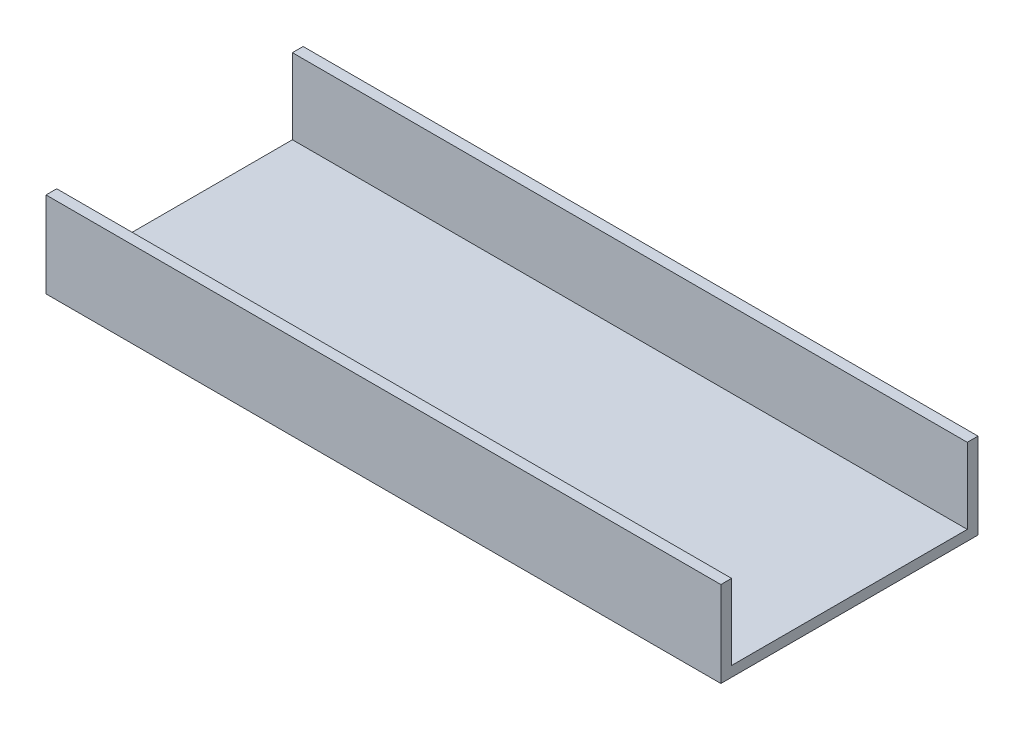
ISO-10303-21;
HEADER;
FILE_DESCRIPTION(('STEP AP214'),'2;1');
FILE_NAME('part.step','',(''),(''),'','','');
FILE_SCHEMA(('AUTOMOTIVE_DESIGN { 1 0 10303 214 1 1 1 1 }'));
ENDSEC;
DATA;
#1=APPLICATION_CONTEXT('core data for automotive mechanical design processes');
#2=APPLICATION_PROTOCOL_DEFINITION('international standard','automotive_design',2000,#1);
#3=PRODUCT_CONTEXT('',#1,'mechanical');
#4=PRODUCT('Part','Part','',(#3));
#5=PRODUCT_RELATED_PRODUCT_CATEGORY('part','',(#4));
#6=PRODUCT_DEFINITION_FORMATION('','',#4);
#7=PRODUCT_DEFINITION_CONTEXT('part definition',#1,'design');
#8=PRODUCT_DEFINITION('design','',#6,#7);
#9=PRODUCT_DEFINITION_SHAPE('','',#8);
#10=(LENGTH_UNIT() NAMED_UNIT(*) SI_UNIT(.MILLI.,.METRE.));
#11=(NAMED_UNIT(*) PLANE_ANGLE_UNIT() SI_UNIT($,.RADIAN.));
#12=(NAMED_UNIT(*) SI_UNIT($,.STERADIAN.) SOLID_ANGLE_UNIT());
#13=UNCERTAINTY_MEASURE_WITH_UNIT(LENGTH_MEASURE(1.E-05),#10,'distance_accuracy_value','');
#14=(GEOMETRIC_REPRESENTATION_CONTEXT(3) GLOBAL_UNCERTAINTY_ASSIGNED_CONTEXT((#13)) GLOBAL_UNIT_ASSIGNED_CONTEXT((#10,
#11,#12)) REPRESENTATION_CONTEXT('',''));
#15=CARTESIAN_POINT('',(0.,0.,0.));
#16=DIRECTION('',(0.,0.,1.));
#17=DIRECTION('',(1.,0.,0.));
#18=AXIS2_PLACEMENT_3D('',#15,#16,#17);
#19=CARTESIAN_POINT('',(200.,22.352,-48.7480799852219));
#20=DIRECTION('',(0.,-1.,0.));
#21=DIRECTION('',(0.,0.,-1.));
#22=AXIS2_PLACEMENT_3D('',#19,#20,#21);
#23=PLANE('',#22);
#24=DIRECTION('',(0.,0.,1.));
#25=VECTOR('',#24,1.);
#26=CARTESIAN_POINT('',(0.,22.352,-48.7480799852219));
#27=LINE('',#26,#25);
#28=CARTESIAN_POINT('',(0.,22.352,-51.9230799852219));
#29=VERTEX_POINT('',#28);
#30=CARTESIAN_POINT('',(0.,22.352,-48.7480799852219));
#31=VERTEX_POINT('',#30);
#32=EDGE_CURVE('E129',#29,#31,#27,.T.);
#33=ORIENTED_EDGE('',*,*,#32,.T.);
#34=DIRECTION('',(-1.,0.,0.));
#35=VECTOR('',#34,1.);
#36=CARTESIAN_POINT('',(200.,22.352,-48.7480799852219));
#37=LINE('',#36,#35);
#38=CARTESIAN_POINT('',(200.,22.352,-48.7480799852219));
#39=VERTEX_POINT('',#38);
#40=EDGE_CURVE('E11',#39,#31,#37,.T.);
#41=ORIENTED_EDGE('',*,*,#40,.F.);
#42=DIRECTION('',(0.,0.,1.));
#43=VECTOR('',#42,1.);
#44=CARTESIAN_POINT('',(200.,22.352,-48.7480799852219));
#45=LINE('',#44,#43);
#46=CARTESIAN_POINT('',(200.,22.352,-51.9230799852219));
#47=VERTEX_POINT('',#46);
#48=EDGE_CURVE('E143',#47,#39,#45,.T.);
#49=ORIENTED_EDGE('',*,*,#48,.F.);
#50=DIRECTION('',(-1.,0.,0.));
#51=VECTOR('',#50,1.);
#52=CARTESIAN_POINT('',(200.,22.352,-51.9230799852219));
#53=LINE('',#52,#51);
#54=EDGE_CURVE('E125',#47,#29,#53,.T.);
#55=ORIENTED_EDGE('',*,*,#54,.T.);
#56=EDGE_LOOP('',(#33,#41,#49,#55));
#57=FACE_BOUND('',#56,.T.);
#58=ADVANCED_FACE('F33',(#57),#23,.F.);
#59=CARTESIAN_POINT('',(200.,22.352,-48.7480799852219));
#60=DIRECTION('',(0.,0.,-1.));
#61=DIRECTION('',(-1.,0.,0.));
#62=AXIS2_PLACEMENT_3D('',#59,#60,#61);
#63=PLANE('',#62);
#64=DIRECTION('',(0.,-1.,0.));
#65=VECTOR('',#64,1.);
#66=CARTESIAN_POINT('',(0.,22.352,-48.7480799852219));
#67=LINE('',#66,#65);
#68=CARTESIAN_POINT('',(0.,0.,-48.7480799852219));
#69=VERTEX_POINT('',#68);
#70=EDGE_CURVE('E132',#31,#69,#67,.T.);
#71=ORIENTED_EDGE('',*,*,#70,.T.);
#72=DIRECTION('',(-1.,0.,0.));
#73=VECTOR('',#72,1.);
#74=CARTESIAN_POINT('',(200.,0.,-48.7480799852219));
#75=LINE('',#74,#73);
#76=CARTESIAN_POINT('',(200.,0.,-48.7480799852219));
#77=VERTEX_POINT('',#76);
#78=EDGE_CURVE('E41',#77,#69,#75,.T.);
#79=ORIENTED_EDGE('',*,*,#78,.F.);
#80=DIRECTION('',(0.,-1.,0.));
#81=VECTOR('',#80,1.);
#82=CARTESIAN_POINT('',(200.,22.352,-48.7480799852219));
#83=LINE('',#82,#81);
#84=EDGE_CURVE('E92',#39,#77,#83,.T.);
#85=ORIENTED_EDGE('',*,*,#84,.F.);
#86=ORIENTED_EDGE('',*,*,#40,.T.);
#87=EDGE_LOOP('',(#71,#79,#85,#86));
#88=FACE_BOUND('',#87,.T.);
#89=ADVANCED_FACE('F178',(#88),#63,.F.);
#90=CARTESIAN_POINT('',(200.,0.,-48.7480799852219));
#91=DIRECTION('',(0.,-1.,0.));
#92=DIRECTION('',(0.,0.,-1.));
#93=AXIS2_PLACEMENT_3D('',#90,#91,#92);
#94=PLANE('',#93);
#95=DIRECTION('',(0.,0.,1.));
#96=VECTOR('',#95,1.);
#97=CARTESIAN_POINT('',(0.,0.,-48.7480799852219));
#98=LINE('',#97,#96);
#99=CARTESIAN_POINT('',(0.,0.,21.1019200147781));
#100=VERTEX_POINT('',#99);
#101=EDGE_CURVE('E134',#69,#100,#98,.T.);
#102=ORIENTED_EDGE('',*,*,#101,.T.);
#103=DIRECTION('',(-1.,0.,0.));
#104=VECTOR('',#103,1.);
#105=CARTESIAN_POINT('',(200.,0.,21.1019200147781));
#106=LINE('',#105,#104);
#107=CARTESIAN_POINT('',(200.,0.,21.1019200147781));
#108=VERTEX_POINT('',#107);
#109=EDGE_CURVE('E150',#108,#100,#106,.T.);
#110=ORIENTED_EDGE('',*,*,#109,.F.);
#111=DIRECTION('',(0.,0.,1.));
#112=VECTOR('',#111,1.);
#113=CARTESIAN_POINT('',(200.,0.,-48.7480799852219));
#114=LINE('',#113,#112);
#115=EDGE_CURVE('E158',#77,#108,#114,.T.);
#116=ORIENTED_EDGE('',*,*,#115,.F.);
#117=ORIENTED_EDGE('',*,*,#78,.T.);
#118=EDGE_LOOP('',(#102,#110,#116,#117));
#119=FACE_BOUND('',#118,.T.);
#120=ADVANCED_FACE('F156',(#119),#94,.F.);
#121=CARTESIAN_POINT('',(200.,0.,21.1019200147781));
#122=DIRECTION('',(0.,0.,1.));
#123=DIRECTION('',(1.,0.,0.));
#124=AXIS2_PLACEMENT_3D('',#121,#122,#123);
#125=PLANE('',#124);
#126=DIRECTION('',(0.,1.,0.));
#127=VECTOR('',#126,1.);
#128=CARTESIAN_POINT('',(0.,0.,21.1019200147781));
#129=LINE('',#128,#127);
#130=CARTESIAN_POINT('',(0.,22.352,21.1019200147781));
#131=VERTEX_POINT('',#130);
#132=EDGE_CURVE('E136',#100,#131,#129,.T.);
#133=ORIENTED_EDGE('',*,*,#132,.T.);
#134=DIRECTION('',(-1.,0.,0.));
#135=VECTOR('',#134,1.);
#136=CARTESIAN_POINT('',(200.,22.352,21.1019200147781));
#137=LINE('',#136,#135);
#138=CARTESIAN_POINT('',(200.,22.352,21.1019200147781));
#139=VERTEX_POINT('',#138);
#140=EDGE_CURVE('E147',#139,#131,#137,.T.);
#141=ORIENTED_EDGE('',*,*,#140,.F.);
#142=DIRECTION('',(0.,1.,0.));
#143=VECTOR('',#142,1.);
#144=CARTESIAN_POINT('',(200.,0.,21.1019200147781));
#145=LINE('',#144,#143);
#146=EDGE_CURVE('E170',#108,#139,#145,.T.);
#147=ORIENTED_EDGE('',*,*,#146,.F.);
#148=ORIENTED_EDGE('',*,*,#109,.T.);
#149=EDGE_LOOP('',(#133,#141,#147,#148));
#150=FACE_BOUND('',#149,.T.);
#151=ADVANCED_FACE('F166',(#150),#125,.F.);
#152=CARTESIAN_POINT('',(200.,22.352,24.2769200147781));
#153=DIRECTION('',(0.,-1.,0.));
#154=DIRECTION('',(0.,0.,-1.));
#155=AXIS2_PLACEMENT_3D('',#152,#153,#154);
#156=PLANE('',#155);
#157=DIRECTION('',(0.,0.,1.));
#158=VECTOR('',#157,1.);
#159=CARTESIAN_POINT('',(0.,22.352,24.2769200147781));
#160=LINE('',#159,#158);
#161=CARTESIAN_POINT('',(0.,22.352,24.2769200147781));
#162=VERTEX_POINT('',#161);
#163=EDGE_CURVE('E138',#131,#162,#160,.T.);
#164=ORIENTED_EDGE('',*,*,#163,.T.);
#165=DIRECTION('',(-1.,0.,0.));
#166=VECTOR('',#165,1.);
#167=CARTESIAN_POINT('',(200.,22.352,24.2769200147781));
#168=LINE('',#167,#166);
#169=CARTESIAN_POINT('',(200.,22.352,24.2769200147781));
#170=VERTEX_POINT('',#169);
#171=EDGE_CURVE('E120',#170,#162,#168,.T.);
#172=ORIENTED_EDGE('',*,*,#171,.F.);
#173=DIRECTION('',(0.,0.,1.));
#174=VECTOR('',#173,1.);
#175=CARTESIAN_POINT('',(200.,22.352,24.2769200147781));
#176=LINE('',#175,#174);
#177=EDGE_CURVE('E111',#139,#170,#176,.T.);
#178=ORIENTED_EDGE('',*,*,#177,.F.);
#179=ORIENTED_EDGE('',*,*,#140,.T.);
#180=EDGE_LOOP('',(#164,#172,#178,#179));
#181=FACE_BOUND('',#180,.T.);
#182=ADVANCED_FACE('F169',(#181),#156,.F.);
#183=CARTESIAN_POINT('',(200.,-3.04800000000001,24.2769200147781));
#184=DIRECTION('',(0.,0.,-1.));
#185=DIRECTION('',(-1.,0.,0.));
#186=AXIS2_PLACEMENT_3D('',#183,#184,#185);
#187=PLANE('',#186);
#188=DIRECTION('',(0.,-1.,0.));
#189=VECTOR('',#188,1.);
#190=CARTESIAN_POINT('',(0.,-3.04800000000001,24.2769200147781));
#191=LINE('',#190,#189);
#192=CARTESIAN_POINT('',(0.,-3.04800000000001,24.2769200147781));
#193=VERTEX_POINT('',#192);
#194=EDGE_CURVE('E119',#162,#193,#191,.T.);
#195=ORIENTED_EDGE('',*,*,#194,.T.);
#196=DIRECTION('',(-1.,0.,0.));
#197=VECTOR('',#196,1.);
#198=CARTESIAN_POINT('',(200.,-3.04800000000001,24.2769200147781));
#199=LINE('',#198,#197);
#200=CARTESIAN_POINT('',(200.,-3.04800000000001,24.2769200147781));
#201=VERTEX_POINT('',#200);
#202=EDGE_CURVE('E116',#201,#193,#199,.T.);
#203=ORIENTED_EDGE('',*,*,#202,.F.);
#204=DIRECTION('',(0.,-1.,0.));
#205=VECTOR('',#204,1.);
#206=CARTESIAN_POINT('',(200.,-3.04800000000001,24.2769200147781));
#207=LINE('',#206,#205);
#208=EDGE_CURVE('E105',#170,#201,#207,.T.);
#209=ORIENTED_EDGE('',*,*,#208,.F.);
#210=ORIENTED_EDGE('',*,*,#171,.T.);
#211=EDGE_LOOP('',(#195,#203,#209,#210));
#212=FACE_BOUND('',#211,.T.);
#213=ADVANCED_FACE('F117',(#212),#187,.F.);
#214=CARTESIAN_POINT('',(200.,-3.048,-51.9230799852219));
#215=DIRECTION('',(0.,1.,0.));
#216=DIRECTION('',(0.,0.,1.));
#217=AXIS2_PLACEMENT_3D('',#214,#215,#216);
#218=PLANE('',#217);
#219=DIRECTION('',(0.,0.,-1.));
#220=VECTOR('',#219,1.);
#221=CARTESIAN_POINT('',(0.,-3.048,-51.9230799852219));
#222=LINE('',#221,#220);
#223=CARTESIAN_POINT('',(0.,-3.048,-51.9230799852219));
#224=VERTEX_POINT('',#223);
#225=EDGE_CURVE('E78',#193,#224,#222,.T.);
#226=ORIENTED_EDGE('',*,*,#225,.T.);
#227=DIRECTION('',(-1.,0.,0.));
#228=VECTOR('',#227,1.);
#229=CARTESIAN_POINT('',(200.,-3.048,-51.9230799852219));
#230=LINE('',#229,#228);
#231=CARTESIAN_POINT('',(200.,-3.048,-51.9230799852219));
#232=VERTEX_POINT('',#231);
#233=EDGE_CURVE('E121',#232,#224,#230,.T.);
#234=ORIENTED_EDGE('',*,*,#233,.F.);
#235=DIRECTION('',(0.,0.,-1.));
#236=VECTOR('',#235,1.);
#237=CARTESIAN_POINT('',(200.,-3.048,-51.9230799852219));
#238=LINE('',#237,#236);
#239=EDGE_CURVE('E109',#201,#232,#238,.T.);
#240=ORIENTED_EDGE('',*,*,#239,.F.);
#241=ORIENTED_EDGE('',*,*,#202,.T.);
#242=EDGE_LOOP('',(#226,#234,#240,#241));
#243=FACE_BOUND('',#242,.T.);
#244=ADVANCED_FACE('F123',(#243),#218,.F.);
#245=CARTESIAN_POINT('',(200.,22.352,-51.9230799852219));
#246=DIRECTION('',(0.,0.,1.));
#247=DIRECTION('',(1.,0.,0.));
#248=AXIS2_PLACEMENT_3D('',#245,#246,#247);
#249=PLANE('',#248);
#250=DIRECTION('',(0.,1.,0.));
#251=VECTOR('',#250,1.);
#252=CARTESIAN_POINT('',(0.,22.352,-51.9230799852219));
#253=LINE('',#252,#251);
#254=EDGE_CURVE('E84',#224,#29,#253,.T.);
#255=ORIENTED_EDGE('',*,*,#254,.T.);
#256=ORIENTED_EDGE('',*,*,#54,.F.);
#257=DIRECTION('',(0.,1.,0.));
#258=VECTOR('',#257,1.);
#259=CARTESIAN_POINT('',(200.,22.352,-51.9230799852219));
#260=LINE('',#259,#258);
#261=EDGE_CURVE('E49',#232,#47,#260,.T.);
#262=ORIENTED_EDGE('',*,*,#261,.F.);
#263=ORIENTED_EDGE('',*,*,#233,.T.);
#264=EDGE_LOOP('',(#255,#256,#262,#263));
#265=FACE_BOUND('',#264,.T.);
#266=ADVANCED_FACE('F194',(#265),#249,.F.);
#267=CARTESIAN_POINT('',(200.,0.,0.));
#268=DIRECTION('',(-1.,0.,0.));
#269=DIRECTION('',(0.,0.,1.));
#270=AXIS2_PLACEMENT_3D('',#267,#268,#269);
#271=PLANE('',#270);
#272=ORIENTED_EDGE('',*,*,#48,.T.);
#273=ORIENTED_EDGE('',*,*,#84,.T.);
#274=ORIENTED_EDGE('',*,*,#115,.T.);
#275=ORIENTED_EDGE('',*,*,#146,.T.);
#276=ORIENTED_EDGE('',*,*,#177,.T.);
#277=ORIENTED_EDGE('',*,*,#208,.T.);
#278=ORIENTED_EDGE('',*,*,#239,.T.);
#279=ORIENTED_EDGE('',*,*,#261,.T.);
#280=EDGE_LOOP('',(#272,#273,#274,#275,#276,#277,#278,#279));
#281=FACE_BOUND('',#280,.T.);
#282=ADVANCED_FACE('F107',(#281),#271,.F.);
#283=CARTESIAN_POINT('',(0.,0.,0.));
#284=DIRECTION('',(-1.,0.,0.));
#285=DIRECTION('',(0.,0.,1.));
#286=AXIS2_PLACEMENT_3D('',#283,#284,#285);
#287=PLANE('',#286);
#288=ORIENTED_EDGE('',*,*,#32,.F.);
#289=ORIENTED_EDGE('',*,*,#254,.F.);
#290=ORIENTED_EDGE('',*,*,#225,.F.);
#291=ORIENTED_EDGE('',*,*,#194,.F.);
#292=ORIENTED_EDGE('',*,*,#163,.F.);
#293=ORIENTED_EDGE('',*,*,#132,.F.);
#294=ORIENTED_EDGE('',*,*,#101,.F.);
#295=ORIENTED_EDGE('',*,*,#70,.F.);
#296=EDGE_LOOP('',(#288,#289,#290,#291,#292,#293,#294,#295));
#297=FACE_BOUND('',#296,.T.);
#298=ADVANCED_FACE('F162',(#297),#287,.T.);
#299=CLOSED_SHELL('',(#58,#89,#120,#151,#182,#213,#244,#266,#282,#298));
#300=MANIFOLD_SOLID_BREP('B2',#299);
#301=ADVANCED_BREP_SHAPE_REPRESENTATION('',(#18,#300),#14);
#302=SHAPE_DEFINITION_REPRESENTATION(#9,#301);
ENDSEC;
END-ISO-10303-21;
